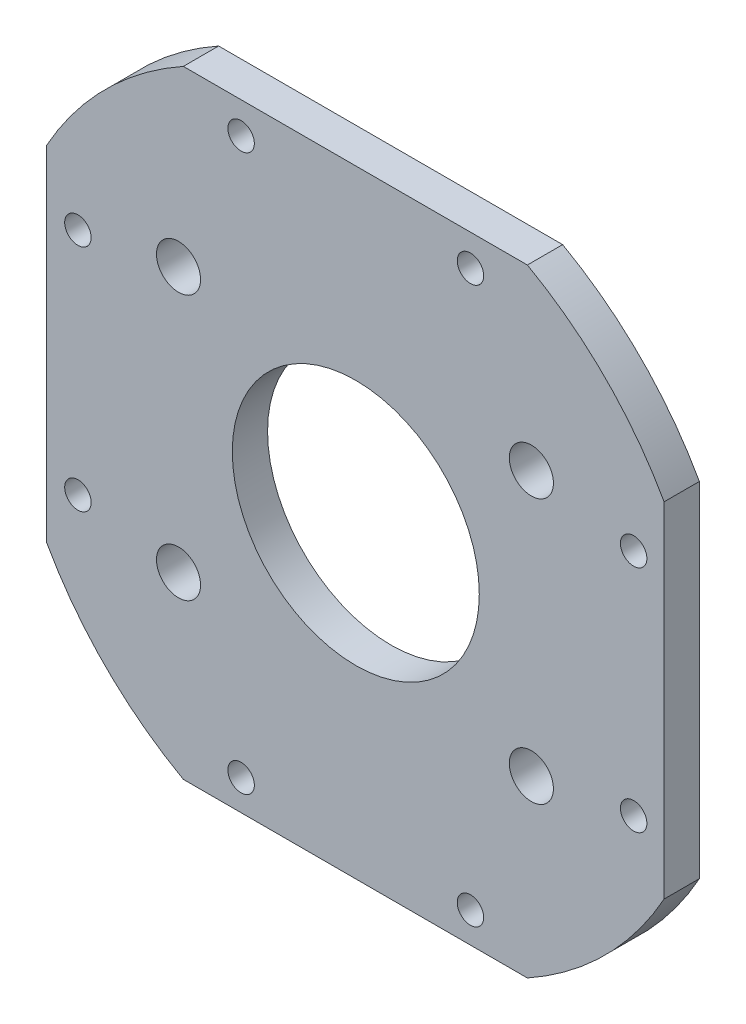
ISO-10303-21;
HEADER;
FILE_DESCRIPTION(('STEP AP214'),'2;1');
FILE_NAME('part.step','',(''),(''),'','','');
FILE_SCHEMA(('AUTOMOTIVE_DESIGN { 1 0 10303 214 1 1 1 1 }'));
ENDSEC;
DATA;
#1=APPLICATION_CONTEXT('core data for automotive mechanical design processes');
#2=APPLICATION_PROTOCOL_DEFINITION('international standard','automotive_design',2000,#1);
#3=PRODUCT_CONTEXT('',#1,'mechanical');
#4=PRODUCT('Part','Part','',(#3));
#5=PRODUCT_RELATED_PRODUCT_CATEGORY('part','',(#4));
#6=PRODUCT_DEFINITION_FORMATION('','',#4);
#7=PRODUCT_DEFINITION_CONTEXT('part definition',#1,'design');
#8=PRODUCT_DEFINITION('design','',#6,#7);
#9=PRODUCT_DEFINITION_SHAPE('','',#8);
#10=(LENGTH_UNIT() NAMED_UNIT(*) SI_UNIT(.MILLI.,.METRE.));
#11=(NAMED_UNIT(*) PLANE_ANGLE_UNIT() SI_UNIT($,.RADIAN.));
#12=(NAMED_UNIT(*) SI_UNIT($,.STERADIAN.) SOLID_ANGLE_UNIT());
#13=UNCERTAINTY_MEASURE_WITH_UNIT(LENGTH_MEASURE(1.E-05),#10,'distance_accuracy_value','');
#14=(GEOMETRIC_REPRESENTATION_CONTEXT(3) GLOBAL_UNCERTAINTY_ASSIGNED_CONTEXT((#13)) GLOBAL_UNIT_ASSIGNED_CONTEXT((#10,
#11,#12)) REPRESENTATION_CONTEXT('',''));
#15=CARTESIAN_POINT('',(0.,0.,0.));
#16=DIRECTION('',(0.,0.,1.));
#17=DIRECTION('',(1.,0.,0.));
#18=AXIS2_PLACEMENT_3D('',#15,#16,#17);
#19=CARTESIAN_POINT('',(-0.048207779633349,0.0482077796333386,4.));
#20=DIRECTION('',(0.,0.,1.));
#21=DIRECTION('',(1.,0.,0.));
#22=AXIS2_PLACEMENT_3D('',#19,#20,#21);
#23=PLANE('',#22);
#24=CARTESIAN_POINT('',(-31.4517922203667,12.9517922203667,4.));
#25=DIRECTION('',(0.,0.,1.));
#26=DIRECTION('',(1.,0.,0.));
#27=AXIS2_PLACEMENT_3D('',#24,#25,#26);
#28=CIRCLE('',#27,1.5);
#29=CARTESIAN_POINT('',(-29.9517922203667,12.9517922203667,4.));
#30=VERTEX_POINT('',#29);
#31=EDGE_CURVE('E245',#30,#30,#28,.T.);
#32=ORIENTED_EDGE('',*,*,#31,.F.);
#33=EDGE_LOOP('',(#32));
#34=FACE_BOUND('',#33,.T.);
#35=CARTESIAN_POINT('',(-12.9517922203666,-31.5482077796333,4.));
#36=DIRECTION('',(0.,0.,1.));
#37=DIRECTION('',(1.,0.,0.));
#38=AXIS2_PLACEMENT_3D('',#35,#36,#37);
#39=CIRCLE('',#38,1.5);
#40=CARTESIAN_POINT('',(-11.4517922203666,-31.5482077796333,4.));
#41=VERTEX_POINT('',#40);
#42=EDGE_CURVE('E233',#41,#41,#39,.T.);
#43=ORIENTED_EDGE('',*,*,#42,.F.);
#44=EDGE_LOOP('',(#43));
#45=FACE_BOUND('',#44,.T.);
#46=CARTESIAN_POINT('',(31.5482077796333,-13.0482077796333,4.));
#47=DIRECTION('',(0.,0.,1.));
#48=DIRECTION('',(1.,0.,0.));
#49=AXIS2_PLACEMENT_3D('',#46,#47,#48);
#50=CIRCLE('',#49,1.5);
#51=CARTESIAN_POINT('',(33.0482077796333,-13.0482077796333,4.));
#52=VERTEX_POINT('',#51);
#53=EDGE_CURVE('E221',#52,#52,#50,.T.);
#54=ORIENTED_EDGE('',*,*,#53,.F.);
#55=EDGE_LOOP('',(#54));
#56=FACE_BOUND('',#55,.T.);
#57=CARTESIAN_POINT('',(13.0482077796334,31.4517922203667,4.));
#58=DIRECTION('',(0.,0.,1.));
#59=DIRECTION('',(1.,0.,0.));
#60=AXIS2_PLACEMENT_3D('',#57,#58,#59);
#61=CIRCLE('',#60,1.5);
#62=CARTESIAN_POINT('',(14.5482077796334,31.4517922203667,4.));
#63=VERTEX_POINT('',#62);
#64=EDGE_CURVE('E209',#63,#63,#61,.T.);
#65=ORIENTED_EDGE('',*,*,#64,.F.);
#66=EDGE_LOOP('',(#65));
#67=FACE_BOUND('',#66,.T.);
#68=CARTESIAN_POINT('',(-20.0482077796334,15.0482077796333,4.));
#69=DIRECTION('',(0.,0.,1.));
#70=DIRECTION('',(1.,0.,0.));
#71=AXIS2_PLACEMENT_3D('',#68,#69,#70);
#72=CIRCLE('',#71,2.5);
#73=CARTESIAN_POINT('',(-17.5482077796334,15.0482077796333,4.));
#74=VERTEX_POINT('',#73);
#75=EDGE_CURVE('E197',#74,#74,#72,.T.);
#76=ORIENTED_EDGE('',*,*,#75,.F.);
#77=EDGE_LOOP('',(#76));
#78=FACE_BOUND('',#77,.T.);
#79=CARTESIAN_POINT('',(-20.0482077796334,-14.9517922203667,4.));
#80=DIRECTION('',(0.,0.,1.));
#81=DIRECTION('',(1.,0.,0.));
#82=AXIS2_PLACEMENT_3D('',#79,#80,#81);
#83=CIRCLE('',#82,2.5);
#84=CARTESIAN_POINT('',(-17.5482077796334,-14.9517922203667,4.));
#85=VERTEX_POINT('',#84);
#86=EDGE_CURVE('E185',#85,#85,#83,.T.);
#87=ORIENTED_EDGE('',*,*,#86,.F.);
#88=EDGE_LOOP('',(#87));
#89=FACE_BOUND('',#88,.T.);
#90=CARTESIAN_POINT('',(-0.048207779633349,0.0482077796333386,4.));
#91=DIRECTION('',(0.,0.,1.));
#92=DIRECTION('',(1.,0.,0.));
#93=AXIS2_PLACEMENT_3D('',#90,#91,#92);
#94=CIRCLE('',#93,40.);
#95=CARTESIAN_POINT('',(-19.5,35.,4.));
#96=VERTEX_POINT('',#95);
#97=CARTESIAN_POINT('',(-35.,19.5,4.));
#98=VERTEX_POINT('',#97);
#99=EDGE_CURVE('E148',#96,#98,#94,.T.);
#100=ORIENTED_EDGE('',*,*,#99,.T.);
#101=DIRECTION('',(0.,-1.,0.));
#102=VECTOR('',#101,1.);
#103=CARTESIAN_POINT('',(-35.,-19.5,4.));
#104=LINE('',#103,#102);
#105=CARTESIAN_POINT('',(-35.,-19.5,4.));
#106=VERTEX_POINT('',#105);
#107=EDGE_CURVE('E96',#98,#106,#104,.T.);
#108=ORIENTED_EDGE('',*,*,#107,.T.);
#109=CARTESIAN_POINT('',(-0.0482077796333524,-0.0482077796333247,4.));
#110=DIRECTION('',(0.,0.,1.));
#111=DIRECTION('',(1.,0.,0.));
#112=AXIS2_PLACEMENT_3D('',#109,#110,#111);
#113=CIRCLE('',#112,40.);
#114=CARTESIAN_POINT('',(-19.5,-35.,4.));
#115=VERTEX_POINT('',#114);
#116=EDGE_CURVE('E163',#106,#115,#113,.T.);
#117=ORIENTED_EDGE('',*,*,#116,.T.);
#118=DIRECTION('',(1.,0.,0.));
#119=VECTOR('',#118,1.);
#120=CARTESIAN_POINT('',(19.5,-35.,4.));
#121=LINE('',#120,#119);
#122=CARTESIAN_POINT('',(19.5,-35.,4.));
#123=VERTEX_POINT('',#122);
#124=EDGE_CURVE('E176',#115,#123,#121,.T.);
#125=ORIENTED_EDGE('',*,*,#124,.T.);
#126=CARTESIAN_POINT('',(0.0482077796333524,-0.0482077796333247,4.));
#127=DIRECTION('',(0.,0.,1.));
#128=DIRECTION('',(-1.,0.,0.));
#129=AXIS2_PLACEMENT_3D('',#126,#127,#128);
#130=CIRCLE('',#129,40.);
#131=CARTESIAN_POINT('',(35.,-19.5,4.));
#132=VERTEX_POINT('',#131);
#133=EDGE_CURVE('E115',#123,#132,#130,.T.);
#134=ORIENTED_EDGE('',*,*,#133,.T.);
#135=DIRECTION('',(0.,1.,0.));
#136=VECTOR('',#135,1.);
#137=CARTESIAN_POINT('',(35.,19.5,4.));
#138=LINE('',#137,#136);
#139=CARTESIAN_POINT('',(35.,19.5,4.));
#140=VERTEX_POINT('',#139);
#141=EDGE_CURVE('E109',#132,#140,#138,.T.);
#142=ORIENTED_EDGE('',*,*,#141,.T.);
#143=CARTESIAN_POINT('',(0.048207779633349,0.0482077796333455,4.));
#144=DIRECTION('',(0.,0.,1.));
#145=DIRECTION('',(-1.,0.,0.));
#146=AXIS2_PLACEMENT_3D('',#143,#144,#145);
#147=CIRCLE('',#146,40.);
#148=CARTESIAN_POINT('',(19.5,35.,4.));
#149=VERTEX_POINT('',#148);
#150=EDGE_CURVE('E113',#140,#149,#147,.T.);
#151=ORIENTED_EDGE('',*,*,#150,.T.);
#152=DIRECTION('',(-1.,0.,0.));
#153=VECTOR('',#152,1.);
#154=CARTESIAN_POINT('',(-19.5,35.,4.));
#155=LINE('',#154,#153);
#156=EDGE_CURVE('E53',#149,#96,#155,.T.);
#157=ORIENTED_EDGE('',*,*,#156,.T.);
#158=EDGE_LOOP('',(#100,#108,#117,#125,#134,#142,#151,#157));
#159=FACE_BOUND('',#158,.T.);
#160=CARTESIAN_POINT('',(19.9517922203666,15.0482077796333,4.));
#161=DIRECTION('',(0.,0.,1.));
#162=DIRECTION('',(1.,0.,0.));
#163=AXIS2_PLACEMENT_3D('',#160,#161,#162);
#164=CIRCLE('',#163,2.5);
#165=CARTESIAN_POINT('',(22.4517922203666,15.0482077796333,4.));
#166=VERTEX_POINT('',#165);
#167=EDGE_CURVE('E137',#166,#166,#164,.T.);
#168=ORIENTED_EDGE('',*,*,#167,.F.);
#169=EDGE_LOOP('',(#168));
#170=FACE_BOUND('',#169,.T.);
#171=CARTESIAN_POINT('',(19.9517922203666,-14.9517922203667,4.));
#172=DIRECTION('',(0.,0.,1.));
#173=DIRECTION('',(1.,0.,0.));
#174=AXIS2_PLACEMENT_3D('',#171,#172,#173);
#175=CIRCLE('',#174,2.5);
#176=CARTESIAN_POINT('',(22.4517922203666,-14.9517922203667,4.));
#177=VERTEX_POINT('',#176);
#178=EDGE_CURVE('E191',#177,#177,#175,.T.);
#179=ORIENTED_EDGE('',*,*,#178,.F.);
#180=EDGE_LOOP('',(#179));
#181=FACE_BOUND('',#180,.T.);
#182=CARTESIAN_POINT('',(-12.9517922203666,31.4517922203667,4.));
#183=DIRECTION('',(0.,0.,1.));
#184=DIRECTION('',(1.,0.,0.));
#185=AXIS2_PLACEMENT_3D('',#182,#183,#184);
#186=CIRCLE('',#185,1.5);
#187=CARTESIAN_POINT('',(-11.4517922203666,31.4517922203667,4.));
#188=VERTEX_POINT('',#187);
#189=EDGE_CURVE('E203',#188,#188,#186,.T.);
#190=ORIENTED_EDGE('',*,*,#189,.F.);
#191=EDGE_LOOP('',(#190));
#192=FACE_BOUND('',#191,.T.);
#193=CARTESIAN_POINT('',(31.5482077796333,12.9517922203667,4.));
#194=DIRECTION('',(0.,0.,1.));
#195=DIRECTION('',(1.,0.,0.));
#196=AXIS2_PLACEMENT_3D('',#193,#194,#195);
#197=CIRCLE('',#196,1.5);
#198=CARTESIAN_POINT('',(33.0482077796333,12.9517922203667,4.));
#199=VERTEX_POINT('',#198);
#200=EDGE_CURVE('E215',#199,#199,#197,.T.);
#201=ORIENTED_EDGE('',*,*,#200,.F.);
#202=EDGE_LOOP('',(#201));
#203=FACE_BOUND('',#202,.T.);
#204=CARTESIAN_POINT('',(13.0482077796334,-31.5482077796333,4.));
#205=DIRECTION('',(0.,0.,1.));
#206=DIRECTION('',(1.,0.,0.));
#207=AXIS2_PLACEMENT_3D('',#204,#205,#206);
#208=CIRCLE('',#207,1.5);
#209=CARTESIAN_POINT('',(14.5482077796334,-31.5482077796333,4.));
#210=VERTEX_POINT('',#209);
#211=EDGE_CURVE('E227',#210,#210,#208,.T.);
#212=ORIENTED_EDGE('',*,*,#211,.F.);
#213=EDGE_LOOP('',(#212));
#214=FACE_BOUND('',#213,.T.);
#215=CARTESIAN_POINT('',(-31.4517922203667,-13.0482077796333,4.));
#216=DIRECTION('',(0.,0.,1.));
#217=DIRECTION('',(1.,0.,0.));
#218=AXIS2_PLACEMENT_3D('',#215,#216,#217);
#219=CIRCLE('',#218,1.5);
#220=CARTESIAN_POINT('',(-29.9517922203667,-13.0482077796333,4.));
#221=VERTEX_POINT('',#220);
#222=EDGE_CURVE('E239',#221,#221,#219,.T.);
#223=ORIENTED_EDGE('',*,*,#222,.F.);
#224=EDGE_LOOP('',(#223));
#225=FACE_BOUND('',#224,.T.);
#226=CARTESIAN_POINT('',(0.0482077796333524,-0.0482077796333247,4.));
#227=DIRECTION('',(0.,0.,1.));
#228=DIRECTION('',(1.,0.,0.));
#229=AXIS2_PLACEMENT_3D('',#226,#227,#228);
#230=CIRCLE('',#229,14.);
#231=CARTESIAN_POINT('',(14.0482077796334,-0.0482077796333247,4.));
#232=VERTEX_POINT('',#231);
#233=EDGE_CURVE('E251',#232,#232,#230,.T.);
#234=ORIENTED_EDGE('',*,*,#233,.F.);
#235=EDGE_LOOP('',(#234));
#236=FACE_BOUND('',#235,.T.);
#237=ADVANCED_FACE('F36',(#34,#45,#56,#67,#78,#89,#159,#170,#181,#192,#203,#214,#225,#236),#23,.T.);
#238=CARTESIAN_POINT('',(-0.048207779633349,0.0482077796333386,0.));
#239=DIRECTION('',(0.,0.,1.));
#240=DIRECTION('',(1.,0.,0.));
#241=AXIS2_PLACEMENT_3D('',#238,#239,#240);
#242=PLANE('',#241);
#243=CARTESIAN_POINT('',(-0.048207779633349,0.0482077796333386,0.));
#244=DIRECTION('',(0.,0.,1.));
#245=DIRECTION('',(1.,0.,0.));
#246=AXIS2_PLACEMENT_3D('',#243,#244,#245);
#247=CIRCLE('',#246,40.);
#248=CARTESIAN_POINT('',(-19.5,35.,0.));
#249=VERTEX_POINT('',#248);
#250=CARTESIAN_POINT('',(-35.,19.5,0.));
#251=VERTEX_POINT('',#250);
#252=EDGE_CURVE('E133',#249,#251,#247,.T.);
#253=ORIENTED_EDGE('',*,*,#252,.F.);
#254=DIRECTION('',(-1.,0.,0.));
#255=VECTOR('',#254,1.);
#256=CARTESIAN_POINT('',(-19.5,35.,0.));
#257=LINE('',#256,#255);
#258=CARTESIAN_POINT('',(19.5,35.,0.));
#259=VERTEX_POINT('',#258);
#260=EDGE_CURVE('E88',#259,#249,#257,.T.);
#261=ORIENTED_EDGE('',*,*,#260,.F.);
#262=CARTESIAN_POINT('',(0.048207779633349,0.0482077796333455,0.));
#263=DIRECTION('',(0.,0.,1.));
#264=DIRECTION('',(-1.,0.,0.));
#265=AXIS2_PLACEMENT_3D('',#262,#263,#264);
#266=CIRCLE('',#265,40.);
#267=CARTESIAN_POINT('',(35.,19.5,0.));
#268=VERTEX_POINT('',#267);
#269=EDGE_CURVE('E82',#268,#259,#266,.T.);
#270=ORIENTED_EDGE('',*,*,#269,.F.);
#271=DIRECTION('',(0.,1.,0.));
#272=VECTOR('',#271,1.);
#273=CARTESIAN_POINT('',(35.,19.5,0.));
#274=LINE('',#273,#272);
#275=CARTESIAN_POINT('',(35.,-19.5,0.));
#276=VERTEX_POINT('',#275);
#277=EDGE_CURVE('E123',#276,#268,#274,.T.);
#278=ORIENTED_EDGE('',*,*,#277,.F.);
#279=CARTESIAN_POINT('',(0.0482077796333524,-0.0482077796333247,0.));
#280=DIRECTION('',(0.,0.,1.));
#281=DIRECTION('',(-1.,0.,0.));
#282=AXIS2_PLACEMENT_3D('',#279,#280,#281);
#283=CIRCLE('',#282,40.);
#284=CARTESIAN_POINT('',(19.5,-35.,0.));
#285=VERTEX_POINT('',#284);
#286=EDGE_CURVE('E143',#285,#276,#283,.T.);
#287=ORIENTED_EDGE('',*,*,#286,.F.);
#288=DIRECTION('',(1.,0.,0.));
#289=VECTOR('',#288,1.);
#290=CARTESIAN_POINT('',(19.5,-35.,0.));
#291=LINE('',#290,#289);
#292=CARTESIAN_POINT('',(-19.5,-35.,0.));
#293=VERTEX_POINT('',#292);
#294=EDGE_CURVE('E141',#293,#285,#291,.T.);
#295=ORIENTED_EDGE('',*,*,#294,.F.);
#296=CARTESIAN_POINT('',(-0.0482077796333524,-0.0482077796333247,0.));
#297=DIRECTION('',(0.,0.,1.));
#298=DIRECTION('',(1.,0.,0.));
#299=AXIS2_PLACEMENT_3D('',#296,#297,#298);
#300=CIRCLE('',#299,40.);
#301=CARTESIAN_POINT('',(-35.,-19.5,0.));
#302=VERTEX_POINT('',#301);
#303=EDGE_CURVE('E139',#302,#293,#300,.T.);
#304=ORIENTED_EDGE('',*,*,#303,.F.);
#305=DIRECTION('',(0.,-1.,0.));
#306=VECTOR('',#305,1.);
#307=CARTESIAN_POINT('',(-35.,-19.5,0.));
#308=LINE('',#307,#306);
#309=EDGE_CURVE('E136',#251,#302,#308,.T.);
#310=ORIENTED_EDGE('',*,*,#309,.F.);
#311=EDGE_LOOP('',(#253,#261,#270,#278,#287,#295,#304,#310));
#312=FACE_BOUND('',#311,.T.);
#313=CARTESIAN_POINT('',(19.9517922203666,15.0482077796333,0.));
#314=DIRECTION('',(0.,0.,1.));
#315=DIRECTION('',(1.,0.,0.));
#316=AXIS2_PLACEMENT_3D('',#313,#314,#315);
#317=CIRCLE('',#316,2.5);
#318=CARTESIAN_POINT('',(22.4517922203666,15.0482077796333,0.));
#319=VERTEX_POINT('',#318);
#320=EDGE_CURVE('E182',#319,#319,#317,.T.);
#321=ORIENTED_EDGE('',*,*,#320,.T.);
#322=EDGE_LOOP('',(#321));
#323=FACE_BOUND('',#322,.T.);
#324=CARTESIAN_POINT('',(-20.0482077796334,-14.9517922203667,0.));
#325=DIRECTION('',(0.,0.,1.));
#326=DIRECTION('',(1.,0.,0.));
#327=AXIS2_PLACEMENT_3D('',#324,#325,#326);
#328=CIRCLE('',#327,2.5);
#329=CARTESIAN_POINT('',(-17.5482077796334,-14.9517922203667,0.));
#330=VERTEX_POINT('',#329);
#331=EDGE_CURVE('E188',#330,#330,#328,.T.);
#332=ORIENTED_EDGE('',*,*,#331,.T.);
#333=EDGE_LOOP('',(#332));
#334=FACE_BOUND('',#333,.T.);
#335=CARTESIAN_POINT('',(19.9517922203666,-14.9517922203667,0.));
#336=DIRECTION('',(0.,0.,1.));
#337=DIRECTION('',(1.,0.,0.));
#338=AXIS2_PLACEMENT_3D('',#335,#336,#337);
#339=CIRCLE('',#338,2.5);
#340=CARTESIAN_POINT('',(22.4517922203666,-14.9517922203667,0.));
#341=VERTEX_POINT('',#340);
#342=EDGE_CURVE('E194',#341,#341,#339,.T.);
#343=ORIENTED_EDGE('',*,*,#342,.T.);
#344=EDGE_LOOP('',(#343));
#345=FACE_BOUND('',#344,.T.);
#346=CARTESIAN_POINT('',(-20.0482077796334,15.0482077796333,0.));
#347=DIRECTION('',(0.,0.,1.));
#348=DIRECTION('',(1.,0.,0.));
#349=AXIS2_PLACEMENT_3D('',#346,#347,#348);
#350=CIRCLE('',#349,2.5);
#351=CARTESIAN_POINT('',(-17.5482077796334,15.0482077796333,0.));
#352=VERTEX_POINT('',#351);
#353=EDGE_CURVE('E200',#352,#352,#350,.T.);
#354=ORIENTED_EDGE('',*,*,#353,.T.);
#355=EDGE_LOOP('',(#354));
#356=FACE_BOUND('',#355,.T.);
#357=CARTESIAN_POINT('',(-12.9517922203666,31.4517922203667,0.));
#358=DIRECTION('',(0.,0.,1.));
#359=DIRECTION('',(1.,0.,0.));
#360=AXIS2_PLACEMENT_3D('',#357,#358,#359);
#361=CIRCLE('',#360,1.5);
#362=CARTESIAN_POINT('',(-11.4517922203666,31.4517922203667,0.));
#363=VERTEX_POINT('',#362);
#364=EDGE_CURVE('E206',#363,#363,#361,.T.);
#365=ORIENTED_EDGE('',*,*,#364,.T.);
#366=EDGE_LOOP('',(#365));
#367=FACE_BOUND('',#366,.T.);
#368=CARTESIAN_POINT('',(13.0482077796334,31.4517922203667,0.));
#369=DIRECTION('',(0.,0.,1.));
#370=DIRECTION('',(1.,0.,0.));
#371=AXIS2_PLACEMENT_3D('',#368,#369,#370);
#372=CIRCLE('',#371,1.5);
#373=CARTESIAN_POINT('',(14.5482077796334,31.4517922203667,0.));
#374=VERTEX_POINT('',#373);
#375=EDGE_CURVE('E212',#374,#374,#372,.T.);
#376=ORIENTED_EDGE('',*,*,#375,.T.);
#377=EDGE_LOOP('',(#376));
#378=FACE_BOUND('',#377,.T.);
#379=CARTESIAN_POINT('',(31.5482077796333,12.9517922203667,0.));
#380=DIRECTION('',(0.,0.,1.));
#381=DIRECTION('',(1.,0.,0.));
#382=AXIS2_PLACEMENT_3D('',#379,#380,#381);
#383=CIRCLE('',#382,1.5);
#384=CARTESIAN_POINT('',(33.0482077796333,12.9517922203667,0.));
#385=VERTEX_POINT('',#384);
#386=EDGE_CURVE('E218',#385,#385,#383,.T.);
#387=ORIENTED_EDGE('',*,*,#386,.T.);
#388=EDGE_LOOP('',(#387));
#389=FACE_BOUND('',#388,.T.);
#390=CARTESIAN_POINT('',(31.5482077796333,-13.0482077796333,0.));
#391=DIRECTION('',(0.,0.,1.));
#392=DIRECTION('',(1.,0.,0.));
#393=AXIS2_PLACEMENT_3D('',#390,#391,#392);
#394=CIRCLE('',#393,1.5);
#395=CARTESIAN_POINT('',(33.0482077796333,-13.0482077796333,0.));
#396=VERTEX_POINT('',#395);
#397=EDGE_CURVE('E224',#396,#396,#394,.T.);
#398=ORIENTED_EDGE('',*,*,#397,.T.);
#399=EDGE_LOOP('',(#398));
#400=FACE_BOUND('',#399,.T.);
#401=CARTESIAN_POINT('',(13.0482077796334,-31.5482077796333,0.));
#402=DIRECTION('',(0.,0.,1.));
#403=DIRECTION('',(1.,0.,0.));
#404=AXIS2_PLACEMENT_3D('',#401,#402,#403);
#405=CIRCLE('',#404,1.5);
#406=CARTESIAN_POINT('',(14.5482077796334,-31.5482077796333,0.));
#407=VERTEX_POINT('',#406);
#408=EDGE_CURVE('E230',#407,#407,#405,.T.);
#409=ORIENTED_EDGE('',*,*,#408,.T.);
#410=EDGE_LOOP('',(#409));
#411=FACE_BOUND('',#410,.T.);
#412=CARTESIAN_POINT('',(-12.9517922203666,-31.5482077796333,0.));
#413=DIRECTION('',(0.,0.,1.));
#414=DIRECTION('',(1.,0.,0.));
#415=AXIS2_PLACEMENT_3D('',#412,#413,#414);
#416=CIRCLE('',#415,1.5);
#417=CARTESIAN_POINT('',(-11.4517922203666,-31.5482077796333,0.));
#418=VERTEX_POINT('',#417);
#419=EDGE_CURVE('E236',#418,#418,#416,.T.);
#420=ORIENTED_EDGE('',*,*,#419,.T.);
#421=EDGE_LOOP('',(#420));
#422=FACE_BOUND('',#421,.T.);
#423=CARTESIAN_POINT('',(-31.4517922203667,-13.0482077796333,0.));
#424=DIRECTION('',(0.,0.,1.));
#425=DIRECTION('',(1.,0.,0.));
#426=AXIS2_PLACEMENT_3D('',#423,#424,#425);
#427=CIRCLE('',#426,1.5);
#428=CARTESIAN_POINT('',(-29.9517922203667,-13.0482077796333,0.));
#429=VERTEX_POINT('',#428);
#430=EDGE_CURVE('E242',#429,#429,#427,.T.);
#431=ORIENTED_EDGE('',*,*,#430,.T.);
#432=EDGE_LOOP('',(#431));
#433=FACE_BOUND('',#432,.T.);
#434=CARTESIAN_POINT('',(-31.4517922203667,12.9517922203667,0.));
#435=DIRECTION('',(0.,0.,1.));
#436=DIRECTION('',(1.,0.,0.));
#437=AXIS2_PLACEMENT_3D('',#434,#435,#436);
#438=CIRCLE('',#437,1.5);
#439=CARTESIAN_POINT('',(-29.9517922203667,12.9517922203667,0.));
#440=VERTEX_POINT('',#439);
#441=EDGE_CURVE('E248',#440,#440,#438,.T.);
#442=ORIENTED_EDGE('',*,*,#441,.T.);
#443=EDGE_LOOP('',(#442));
#444=FACE_BOUND('',#443,.T.);
#445=CARTESIAN_POINT('',(0.0482077796333524,-0.0482077796333247,0.));
#446=DIRECTION('',(0.,0.,1.));
#447=DIRECTION('',(1.,0.,0.));
#448=AXIS2_PLACEMENT_3D('',#445,#446,#447);
#449=CIRCLE('',#448,14.);
#450=CARTESIAN_POINT('',(14.0482077796334,-0.0482077796333247,0.));
#451=VERTEX_POINT('',#450);
#452=EDGE_CURVE('E254',#451,#451,#449,.T.);
#453=ORIENTED_EDGE('',*,*,#452,.T.);
#454=EDGE_LOOP('',(#453));
#455=FACE_BOUND('',#454,.T.);
#456=ADVANCED_FACE('F167',(#312,#323,#334,#345,#356,#367,#378,#389,#400,#411,#422,#433,#444,
#455),#242,.F.);
#457=CARTESIAN_POINT('',(-0.048207779633349,0.0482077796333386,4.));
#458=DIRECTION('',(0.,0.,-1.));
#459=DIRECTION('',(-1.,0.,0.));
#460=AXIS2_PLACEMENT_3D('',#457,#458,#459);
#461=CYLINDRICAL_SURFACE('',#460,40.);
#462=ORIENTED_EDGE('',*,*,#252,.T.);
#463=DIRECTION('',(0.,0.,-1.));
#464=VECTOR('',#463,1.);
#465=CARTESIAN_POINT('',(-35.,19.5,4.));
#466=LINE('',#465,#464);
#467=EDGE_CURVE('E11',#98,#251,#466,.T.);
#468=ORIENTED_EDGE('',*,*,#467,.F.);
#469=ORIENTED_EDGE('',*,*,#99,.F.);
#470=DIRECTION('',(0.,0.,-1.));
#471=VECTOR('',#470,1.);
#472=CARTESIAN_POINT('',(-19.5,35.,4.));
#473=LINE('',#472,#471);
#474=EDGE_CURVE('E129',#96,#249,#473,.T.);
#475=ORIENTED_EDGE('',*,*,#474,.T.);
#476=EDGE_LOOP('',(#462,#468,#469,#475));
#477=FACE_BOUND('',#476,.T.);
#478=ADVANCED_FACE('F38',(#477),#461,.T.);
#479=CARTESIAN_POINT('',(-35.,-19.5,4.));
#480=DIRECTION('',(1.,0.,0.));
#481=DIRECTION('',(0.,1.,0.));
#482=AXIS2_PLACEMENT_3D('',#479,#480,#481);
#483=PLANE('',#482);
#484=ORIENTED_EDGE('',*,*,#309,.T.);
#485=DIRECTION('',(0.,0.,-1.));
#486=VECTOR('',#485,1.);
#487=CARTESIAN_POINT('',(-35.,-19.5,4.));
#488=LINE('',#487,#486);
#489=EDGE_CURVE('E45',#106,#302,#488,.T.);
#490=ORIENTED_EDGE('',*,*,#489,.F.);
#491=ORIENTED_EDGE('',*,*,#107,.F.);
#492=ORIENTED_EDGE('',*,*,#467,.T.);
#493=EDGE_LOOP('',(#484,#490,#491,#492));
#494=FACE_BOUND('',#493,.T.);
#495=ADVANCED_FACE('F288',(#494),#483,.F.);
#496=CARTESIAN_POINT('',(-0.0482077796333524,-0.0482077796333247,4.));
#497=DIRECTION('',(0.,0.,-1.));
#498=DIRECTION('',(-1.,0.,0.));
#499=AXIS2_PLACEMENT_3D('',#496,#497,#498);
#500=CYLINDRICAL_SURFACE('',#499,40.);
#501=ORIENTED_EDGE('',*,*,#303,.T.);
#502=DIRECTION('',(0.,0.,-1.));
#503=VECTOR('',#502,1.);
#504=CARTESIAN_POINT('',(-19.5,-35.,4.));
#505=LINE('',#504,#503);
#506=EDGE_CURVE('E155',#115,#293,#505,.T.);
#507=ORIENTED_EDGE('',*,*,#506,.F.);
#508=ORIENTED_EDGE('',*,*,#116,.F.);
#509=ORIENTED_EDGE('',*,*,#489,.T.);
#510=EDGE_LOOP('',(#501,#507,#508,#509));
#511=FACE_BOUND('',#510,.T.);
#512=ADVANCED_FACE('F161',(#511),#500,.T.);
#513=CARTESIAN_POINT('',(19.5,-35.,4.));
#514=DIRECTION('',(0.,1.,0.));
#515=DIRECTION('',(0.,0.,1.));
#516=AXIS2_PLACEMENT_3D('',#513,#514,#515);
#517=PLANE('',#516);
#518=ORIENTED_EDGE('',*,*,#294,.T.);
#519=DIRECTION('',(0.,0.,-1.));
#520=VECTOR('',#519,1.);
#521=CARTESIAN_POINT('',(19.5,-35.,4.));
#522=LINE('',#521,#520);
#523=EDGE_CURVE('E152',#123,#285,#522,.T.);
#524=ORIENTED_EDGE('',*,*,#523,.F.);
#525=ORIENTED_EDGE('',*,*,#124,.F.);
#526=ORIENTED_EDGE('',*,*,#506,.T.);
#527=EDGE_LOOP('',(#518,#524,#525,#526));
#528=FACE_BOUND('',#527,.T.);
#529=ADVANCED_FACE('F172',(#528),#517,.F.);
#530=CARTESIAN_POINT('',(0.0482077796333524,-0.0482077796333247,4.));
#531=DIRECTION('',(0.,0.,-1.));
#532=DIRECTION('',(-1.,0.,0.));
#533=AXIS2_PLACEMENT_3D('',#530,#531,#532);
#534=CYLINDRICAL_SURFACE('',#533,40.);
#535=ORIENTED_EDGE('',*,*,#286,.T.);
#536=DIRECTION('',(0.,0.,-1.));
#537=VECTOR('',#536,1.);
#538=CARTESIAN_POINT('',(35.,-19.5,4.));
#539=LINE('',#538,#537);
#540=EDGE_CURVE('E124',#132,#276,#539,.T.);
#541=ORIENTED_EDGE('',*,*,#540,.F.);
#542=ORIENTED_EDGE('',*,*,#133,.F.);
#543=ORIENTED_EDGE('',*,*,#523,.T.);
#544=EDGE_LOOP('',(#535,#541,#542,#543));
#545=FACE_BOUND('',#544,.T.);
#546=ADVANCED_FACE('F175',(#545),#534,.T.);
#547=CARTESIAN_POINT('',(35.,19.5,4.));
#548=DIRECTION('',(-1.,0.,0.));
#549=DIRECTION('',(0.,0.,1.));
#550=AXIS2_PLACEMENT_3D('',#547,#548,#549);
#551=PLANE('',#550);
#552=ORIENTED_EDGE('',*,*,#277,.T.);
#553=DIRECTION('',(0.,0.,-1.));
#554=VECTOR('',#553,1.);
#555=CARTESIAN_POINT('',(35.,19.5,4.));
#556=LINE('',#555,#554);
#557=EDGE_CURVE('E120',#140,#268,#556,.T.);
#558=ORIENTED_EDGE('',*,*,#557,.F.);
#559=ORIENTED_EDGE('',*,*,#141,.F.);
#560=ORIENTED_EDGE('',*,*,#540,.T.);
#561=EDGE_LOOP('',(#552,#558,#559,#560));
#562=FACE_BOUND('',#561,.T.);
#563=ADVANCED_FACE('F121',(#562),#551,.F.);
#564=CARTESIAN_POINT('',(0.048207779633349,0.0482077796333455,4.));
#565=DIRECTION('',(0.,0.,-1.));
#566=DIRECTION('',(-1.,0.,0.));
#567=AXIS2_PLACEMENT_3D('',#564,#565,#566);
#568=CYLINDRICAL_SURFACE('',#567,40.);
#569=ORIENTED_EDGE('',*,*,#269,.T.);
#570=DIRECTION('',(0.,0.,-1.));
#571=VECTOR('',#570,1.);
#572=CARTESIAN_POINT('',(19.5,35.,4.));
#573=LINE('',#572,#571);
#574=EDGE_CURVE('E125',#149,#259,#573,.T.);
#575=ORIENTED_EDGE('',*,*,#574,.F.);
#576=ORIENTED_EDGE('',*,*,#150,.F.);
#577=ORIENTED_EDGE('',*,*,#557,.T.);
#578=EDGE_LOOP('',(#569,#575,#576,#577));
#579=FACE_BOUND('',#578,.T.);
#580=ADVANCED_FACE('F127',(#579),#568,.T.);
#581=CARTESIAN_POINT('',(-19.5,35.,4.));
#582=DIRECTION('',(0.,-1.,0.));
#583=DIRECTION('',(0.,0.,-1.));
#584=AXIS2_PLACEMENT_3D('',#581,#582,#583);
#585=PLANE('',#584);
#586=ORIENTED_EDGE('',*,*,#260,.T.);
#587=ORIENTED_EDGE('',*,*,#474,.F.);
#588=ORIENTED_EDGE('',*,*,#156,.F.);
#589=ORIENTED_EDGE('',*,*,#574,.T.);
#590=EDGE_LOOP('',(#586,#587,#588,#589));
#591=FACE_BOUND('',#590,.T.);
#592=ADVANCED_FACE('F276',(#591),#585,.F.);
#593=CARTESIAN_POINT('',(19.9517922203666,15.0482077796333,4.));
#594=DIRECTION('',(0.,0.,-1.));
#595=DIRECTION('',(-1.,0.,0.));
#596=AXIS2_PLACEMENT_3D('',#593,#594,#595);
#597=CYLINDRICAL_SURFACE('',#596,2.5);
#598=ORIENTED_EDGE('',*,*,#167,.T.);
#599=EDGE_LOOP('',(#598));
#600=FACE_BOUND('',#599,.T.);
#601=ORIENTED_EDGE('',*,*,#320,.F.);
#602=EDGE_LOOP('',(#601));
#603=FACE_BOUND('',#602,.T.);
#604=ADVANCED_FACE('F273',(#600,#603),#597,.F.);
#605=CARTESIAN_POINT('',(-20.0482077796334,-14.9517922203667,4.));
#606=DIRECTION('',(0.,0.,-1.));
#607=DIRECTION('',(-1.,0.,0.));
#608=AXIS2_PLACEMENT_3D('',#605,#606,#607);
#609=CYLINDRICAL_SURFACE('',#608,2.5);
#610=ORIENTED_EDGE('',*,*,#86,.T.);
#611=EDGE_LOOP('',(#610));
#612=FACE_BOUND('',#611,.T.);
#613=ORIENTED_EDGE('',*,*,#331,.F.);
#614=EDGE_LOOP('',(#613));
#615=FACE_BOUND('',#614,.T.);
#616=ADVANCED_FACE('F352',(#612,#615),#609,.F.);
#617=CARTESIAN_POINT('',(19.9517922203666,-14.9517922203667,4.));
#618=DIRECTION('',(0.,0.,-1.));
#619=DIRECTION('',(-1.,0.,0.));
#620=AXIS2_PLACEMENT_3D('',#617,#618,#619);
#621=CYLINDRICAL_SURFACE('',#620,2.5);
#622=ORIENTED_EDGE('',*,*,#178,.T.);
#623=EDGE_LOOP('',(#622));
#624=FACE_BOUND('',#623,.T.);
#625=ORIENTED_EDGE('',*,*,#342,.F.);
#626=EDGE_LOOP('',(#625));
#627=FACE_BOUND('',#626,.T.);
#628=ADVANCED_FACE('F360',(#624,#627),#621,.F.);
#629=CARTESIAN_POINT('',(-20.0482077796334,15.0482077796333,4.));
#630=DIRECTION('',(0.,0.,-1.));
#631=DIRECTION('',(-1.,0.,0.));
#632=AXIS2_PLACEMENT_3D('',#629,#630,#631);
#633=CYLINDRICAL_SURFACE('',#632,2.5);
#634=ORIENTED_EDGE('',*,*,#75,.T.);
#635=EDGE_LOOP('',(#634));
#636=FACE_BOUND('',#635,.T.);
#637=ORIENTED_EDGE('',*,*,#353,.F.);
#638=EDGE_LOOP('',(#637));
#639=FACE_BOUND('',#638,.T.);
#640=ADVANCED_FACE('F368',(#636,#639),#633,.F.);
#641=CARTESIAN_POINT('',(-12.9517922203666,31.4517922203667,4.));
#642=DIRECTION('',(0.,0.,-1.));
#643=DIRECTION('',(-1.,0.,0.));
#644=AXIS2_PLACEMENT_3D('',#641,#642,#643);
#645=CYLINDRICAL_SURFACE('',#644,1.5);
#646=ORIENTED_EDGE('',*,*,#189,.T.);
#647=EDGE_LOOP('',(#646));
#648=FACE_BOUND('',#647,.T.);
#649=ORIENTED_EDGE('',*,*,#364,.F.);
#650=EDGE_LOOP('',(#649));
#651=FACE_BOUND('',#650,.T.);
#652=ADVANCED_FACE('F377',(#648,#651),#645,.F.);
#653=CARTESIAN_POINT('',(13.0482077796334,31.4517922203667,4.));
#654=DIRECTION('',(0.,0.,-1.));
#655=DIRECTION('',(-1.,0.,0.));
#656=AXIS2_PLACEMENT_3D('',#653,#654,#655);
#657=CYLINDRICAL_SURFACE('',#656,1.5);
#658=ORIENTED_EDGE('',*,*,#64,.T.);
#659=EDGE_LOOP('',(#658));
#660=FACE_BOUND('',#659,.T.);
#661=ORIENTED_EDGE('',*,*,#375,.F.);
#662=EDGE_LOOP('',(#661));
#663=FACE_BOUND('',#662,.T.);
#664=ADVANCED_FACE('F386',(#660,#663),#657,.F.);
#665=CARTESIAN_POINT('',(31.5482077796333,12.9517922203667,4.));
#666=DIRECTION('',(0.,0.,-1.));
#667=DIRECTION('',(-1.,0.,0.));
#668=AXIS2_PLACEMENT_3D('',#665,#666,#667);
#669=CYLINDRICAL_SURFACE('',#668,1.5);
#670=ORIENTED_EDGE('',*,*,#200,.T.);
#671=EDGE_LOOP('',(#670));
#672=FACE_BOUND('',#671,.T.);
#673=ORIENTED_EDGE('',*,*,#386,.F.);
#674=EDGE_LOOP('',(#673));
#675=FACE_BOUND('',#674,.T.);
#676=ADVANCED_FACE('F395',(#672,#675),#669,.F.);
#677=CARTESIAN_POINT('',(31.5482077796333,-13.0482077796333,4.));
#678=DIRECTION('',(0.,0.,-1.));
#679=DIRECTION('',(-1.,0.,0.));
#680=AXIS2_PLACEMENT_3D('',#677,#678,#679);
#681=CYLINDRICAL_SURFACE('',#680,1.5);
#682=ORIENTED_EDGE('',*,*,#53,.T.);
#683=EDGE_LOOP('',(#682));
#684=FACE_BOUND('',#683,.T.);
#685=ORIENTED_EDGE('',*,*,#397,.F.);
#686=EDGE_LOOP('',(#685));
#687=FACE_BOUND('',#686,.T.);
#688=ADVANCED_FACE('F404',(#684,#687),#681,.F.);
#689=CARTESIAN_POINT('',(13.0482077796334,-31.5482077796333,4.));
#690=DIRECTION('',(0.,0.,-1.));
#691=DIRECTION('',(-1.,0.,0.));
#692=AXIS2_PLACEMENT_3D('',#689,#690,#691);
#693=CYLINDRICAL_SURFACE('',#692,1.5);
#694=ORIENTED_EDGE('',*,*,#211,.T.);
#695=EDGE_LOOP('',(#694));
#696=FACE_BOUND('',#695,.T.);
#697=ORIENTED_EDGE('',*,*,#408,.F.);
#698=EDGE_LOOP('',(#697));
#699=FACE_BOUND('',#698,.T.);
#700=ADVANCED_FACE('F413',(#696,#699),#693,.F.);
#701=CARTESIAN_POINT('',(-12.9517922203666,-31.5482077796333,4.));
#702=DIRECTION('',(0.,0.,-1.));
#703=DIRECTION('',(-1.,0.,0.));
#704=AXIS2_PLACEMENT_3D('',#701,#702,#703);
#705=CYLINDRICAL_SURFACE('',#704,1.5);
#706=ORIENTED_EDGE('',*,*,#42,.T.);
#707=EDGE_LOOP('',(#706));
#708=FACE_BOUND('',#707,.T.);
#709=ORIENTED_EDGE('',*,*,#419,.F.);
#710=EDGE_LOOP('',(#709));
#711=FACE_BOUND('',#710,.T.);
#712=ADVANCED_FACE('F422',(#708,#711),#705,.F.);
#713=CARTESIAN_POINT('',(-31.4517922203667,-13.0482077796333,4.));
#714=DIRECTION('',(0.,0.,-1.));
#715=DIRECTION('',(-1.,0.,0.));
#716=AXIS2_PLACEMENT_3D('',#713,#714,#715);
#717=CYLINDRICAL_SURFACE('',#716,1.5);
#718=ORIENTED_EDGE('',*,*,#222,.T.);
#719=EDGE_LOOP('',(#718));
#720=FACE_BOUND('',#719,.T.);
#721=ORIENTED_EDGE('',*,*,#430,.F.);
#722=EDGE_LOOP('',(#721));
#723=FACE_BOUND('',#722,.T.);
#724=ADVANCED_FACE('F431',(#720,#723),#717,.F.);
#725=CARTESIAN_POINT('',(-31.4517922203667,12.9517922203667,4.));
#726=DIRECTION('',(0.,0.,-1.));
#727=DIRECTION('',(-1.,0.,0.));
#728=AXIS2_PLACEMENT_3D('',#725,#726,#727);
#729=CYLINDRICAL_SURFACE('',#728,1.5);
#730=ORIENTED_EDGE('',*,*,#31,.T.);
#731=EDGE_LOOP('',(#730));
#732=FACE_BOUND('',#731,.T.);
#733=ORIENTED_EDGE('',*,*,#441,.F.);
#734=EDGE_LOOP('',(#733));
#735=FACE_BOUND('',#734,.T.);
#736=ADVANCED_FACE('F440',(#732,#735),#729,.F.);
#737=CARTESIAN_POINT('',(0.0482077796333524,-0.0482077796333247,4.));
#738=DIRECTION('',(0.,0.,-1.));
#739=DIRECTION('',(-1.,0.,0.));
#740=AXIS2_PLACEMENT_3D('',#737,#738,#739);
#741=CYLINDRICAL_SURFACE('',#740,14.);
#742=ORIENTED_EDGE('',*,*,#233,.T.);
#743=EDGE_LOOP('',(#742));
#744=FACE_BOUND('',#743,.T.);
#745=ORIENTED_EDGE('',*,*,#452,.F.);
#746=EDGE_LOOP('',(#745));
#747=FACE_BOUND('',#746,.T.);
#748=ADVANCED_FACE('F260',(#744,#747),#741,.F.);
#749=CLOSED_SHELL('',(#237,#456,#478,#495,#512,#529,#546,#563,#580,#592,#604,#616,#628,#640,
#652,#664,#676,#688,#700,#712,#724,#736,#748));
#750=MANIFOLD_SOLID_BREP('B2',#749);
#751=ADVANCED_BREP_SHAPE_REPRESENTATION('',(#18,#750),#14);
#752=SHAPE_DEFINITION_REPRESENTATION(#9,#751);
ENDSEC;
END-ISO-10303-21;
